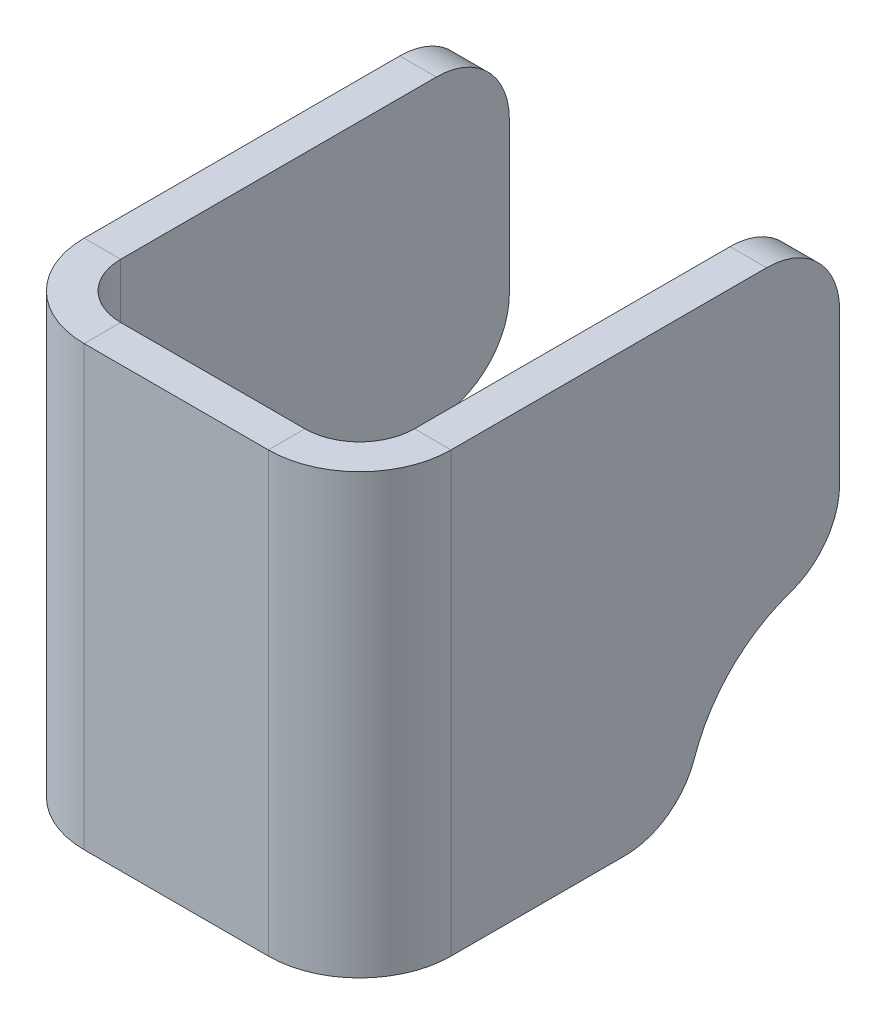
ISO-10303-21;
HEADER;
FILE_DESCRIPTION(('STEP AP214'),'2;1');
FILE_NAME('part.step','',(''),(''),'','','');
FILE_SCHEMA(('AUTOMOTIVE_DESIGN { 1 0 10303 214 1 1 1 1 }'));
ENDSEC;
DATA;
#1=APPLICATION_CONTEXT('core data for automotive mechanical design processes');
#2=APPLICATION_PROTOCOL_DEFINITION('international standard','automotive_design',2000,#1);
#3=PRODUCT_CONTEXT('',#1,'mechanical');
#4=PRODUCT('Part','Part','',(#3));
#5=PRODUCT_RELATED_PRODUCT_CATEGORY('part','',(#4));
#6=PRODUCT_DEFINITION_FORMATION('','',#4);
#7=PRODUCT_DEFINITION_CONTEXT('part definition',#1,'design');
#8=PRODUCT_DEFINITION('design','',#6,#7);
#9=PRODUCT_DEFINITION_SHAPE('','',#8);
#10=(LENGTH_UNIT() NAMED_UNIT(*) SI_UNIT(.MILLI.,.METRE.));
#11=(NAMED_UNIT(*) PLANE_ANGLE_UNIT() SI_UNIT($,.RADIAN.));
#12=(NAMED_UNIT(*) SI_UNIT($,.STERADIAN.) SOLID_ANGLE_UNIT());
#13=UNCERTAINTY_MEASURE_WITH_UNIT(LENGTH_MEASURE(1.E-05),#10,'distance_accuracy_value','');
#14=(GEOMETRIC_REPRESENTATION_CONTEXT(3) GLOBAL_UNCERTAINTY_ASSIGNED_CONTEXT((#13)) GLOBAL_UNIT_ASSIGNED_CONTEXT((#10,
#11,#12)) REPRESENTATION_CONTEXT('',''));
#15=CARTESIAN_POINT('',(0.,0.,0.));
#16=DIRECTION('',(0.,0.,1.));
#17=DIRECTION('',(1.,0.,0.));
#18=AXIS2_PLACEMENT_3D('',#15,#16,#17);
#19=CARTESIAN_POINT('',(32.3017633217904,0.,-79.8098725507499));
#20=DIRECTION('',(0.,1.,0.));
#21=DIRECTION('',(-1.,0.,0.));
#22=AXIS2_PLACEMENT_3D('',#19,#20,#21);
#23=PLANE('',#22);
#24=DIRECTION('',(0.,0.,1.));
#25=VECTOR('',#24,1.);
#26=CARTESIAN_POINT('',(29.1267633217904,0.,-79.8098725507499));
#27=LINE('',#26,#25);
#28=CARTESIAN_POINT('',(29.1267633217903,0.,-46.0375));
#29=VERTEX_POINT('',#28);
#30=CARTESIAN_POINT('',(29.1267633217903,0.,-61.1771935968261));
#31=VERTEX_POINT('',#30);
#32=EDGE_CURVE('E373',#29,#31,#27,.F.);
#33=ORIENTED_EDGE('',*,*,#32,.T.);
#34=DIRECTION('',(1.,0.,0.));
#35=VECTOR('',#34,1.);
#36=CARTESIAN_POINT('',(32.3017633217904,0.,-61.1771935968261));
#37=LINE('',#36,#35);
#38=CARTESIAN_POINT('',(32.3017633217903,0.,-61.1771935968261));
#39=VERTEX_POINT('',#38);
#40=EDGE_CURVE('E13',#31,#39,#37,.T.);
#41=ORIENTED_EDGE('',*,*,#40,.T.);
#42=DIRECTION('',(0.,0.,-1.));
#43=VECTOR('',#42,1.);
#44=CARTESIAN_POINT('',(32.3017633217901,0.,1.21599161523065E-13));
#45=LINE('',#44,#43);
#46=CARTESIAN_POINT('',(32.3017633217903,0.,-46.0375));
#47=VERTEX_POINT('',#46);
#48=EDGE_CURVE('E363',#47,#39,#45,.T.);
#49=ORIENTED_EDGE('',*,*,#48,.F.);
#50=DIRECTION('',(-1.,0.,0.));
#51=VECTOR('',#50,1.);
#52=CARTESIAN_POINT('',(29.1267633217903,0.,-46.0375));
#53=LINE('',#52,#51);
#54=EDGE_CURVE('E380',#29,#47,#53,.F.);
#55=ORIENTED_EDGE('',*,*,#54,.F.);
#56=EDGE_LOOP('',(#33,#41,#49,#55));
#57=FACE_BOUND('',#56,.T.);
#58=ADVANCED_FACE('F91',(#57),#23,.F.);
#59=CARTESIAN_POINT('',(32.3017633217904,38.1000000000016,-79.8098725507499));
#60=DIRECTION('',(0.,0.,1.));
#61=DIRECTION('',(1.,0.,0.));
#62=AXIS2_PLACEMENT_3D('',#59,#60,#61);
#63=PLANE('',#62);
#64=DIRECTION('',(0.,-1.,0.));
#65=VECTOR('',#64,1.);
#66=CARTESIAN_POINT('',(29.1267633217904,38.1000000000016,-79.8098725507499));
#67=LINE('',#66,#65);
#68=CARTESIAN_POINT('',(29.1267633217904,18.6326789539239,-79.8098725507499));
#69=VERTEX_POINT('',#68);
#70=CARTESIAN_POINT('',(29.1267633217904,31.7500000000016,-79.8098725507499));
#71=VERTEX_POINT('',#70);
#72=EDGE_CURVE('E369',#69,#71,#67,.F.);
#73=ORIENTED_EDGE('',*,*,#72,.T.);
#74=DIRECTION('',(-1.,0.,0.));
#75=VECTOR('',#74,1.);
#76=CARTESIAN_POINT('',(32.3017633217904,31.7500000000016,-79.8098725507499));
#77=LINE('',#76,#75);
#78=CARTESIAN_POINT('',(32.3017633217904,31.7500000000016,-79.8098725507499));
#79=VERTEX_POINT('',#78);
#80=EDGE_CURVE('E489',#71,#79,#77,.F.);
#81=ORIENTED_EDGE('',*,*,#80,.T.);
#82=DIRECTION('',(0.,1.,0.));
#83=VECTOR('',#82,1.);
#84=CARTESIAN_POINT('',(32.3017633217904,0.,-79.8098725507499));
#85=LINE('',#84,#83);
#86=CARTESIAN_POINT('',(32.3017633217904,18.6326789539239,-79.8098725507499));
#87=VERTEX_POINT('',#86);
#88=EDGE_CURVE('E359',#87,#79,#85,.T.);
#89=ORIENTED_EDGE('',*,*,#88,.F.);
#90=DIRECTION('',(1.,0.,0.));
#91=VECTOR('',#90,1.);
#92=CARTESIAN_POINT('',(29.1267633217904,18.6326789539239,-79.8098725507499));
#93=LINE('',#92,#91);
#94=EDGE_CURVE('E486',#87,#69,#93,.F.);
#95=ORIENTED_EDGE('',*,*,#94,.T.);
#96=EDGE_LOOP('',(#73,#81,#89,#95));
#97=FACE_BOUND('',#96,.T.);
#98=ADVANCED_FACE('F578',(#97),#63,.F.);
#99=CARTESIAN_POINT('',(0.42476332179028,0.,-41.275));
#100=DIRECTION('',(0.,1.,0.));
#101=DIRECTION('',(-1.,0.,0.));
#102=AXIS2_PLACEMENT_3D('',#99,#100,#101);
#103=PLANE('',#102);
#104=DIRECTION('',(0.,0.,1.));
#105=VECTOR('',#104,1.);
#106=CARTESIAN_POINT('',(0.424763321790424,0.,0.));
#107=LINE('',#106,#105);
#108=CARTESIAN_POINT('',(0.42476332179021,0.,-61.1771935968261));
#109=VERTEX_POINT('',#108);
#110=CARTESIAN_POINT('',(0.424763321790263,0.,-46.0375));
#111=VERTEX_POINT('',#110);
#112=EDGE_CURVE('E303',#109,#111,#107,.T.);
#113=ORIENTED_EDGE('',*,*,#112,.F.);
#114=DIRECTION('',(1.,0.,0.));
#115=VECTOR('',#114,1.);
#116=CARTESIAN_POINT('',(3.59976332179019,0.,-61.1771935968261));
#117=LINE('',#116,#115);
#118=CARTESIAN_POINT('',(3.59976332179021,0.,-61.1771935968261));
#119=VERTEX_POINT('',#118);
#120=EDGE_CURVE('E468',#109,#119,#117,.T.);
#121=ORIENTED_EDGE('',*,*,#120,.T.);
#122=DIRECTION('',(0.,0.,-1.));
#123=VECTOR('',#122,1.);
#124=CARTESIAN_POINT('',(3.59976332179028,0.,-41.275));
#125=LINE('',#124,#123);
#126=CARTESIAN_POINT('',(3.59976332179026,0.,-46.0375));
#127=VERTEX_POINT('',#126);
#128=EDGE_CURVE('E312',#119,#127,#125,.F.);
#129=ORIENTED_EDGE('',*,*,#128,.T.);
#130=DIRECTION('',(1.,0.,0.));
#131=VECTOR('',#130,1.);
#132=CARTESIAN_POINT('',(0.424763321790264,0.,-46.0375));
#133=LINE('',#132,#131);
#134=EDGE_CURVE('E329',#127,#111,#133,.F.);
#135=ORIENTED_EDGE('',*,*,#134,.T.);
#136=EDGE_LOOP('',(#113,#121,#129,#135));
#137=FACE_BOUND('',#136,.T.);
#138=ADVANCED_FACE('F547',(#137),#103,.F.);
#139=CARTESIAN_POINT('',(0.424763321790146,0.,-79.8098725507499));
#140=DIRECTION('',(0.,0.,1.));
#141=DIRECTION('',(1.,0.,0.));
#142=AXIS2_PLACEMENT_3D('',#139,#140,#141);
#143=PLANE('',#142);
#144=DIRECTION('',(0.,1.,0.));
#145=VECTOR('',#144,1.);
#146=CARTESIAN_POINT('',(3.59976332179015,0.,-79.8098725507499));
#147=LINE('',#146,#145);
#148=CARTESIAN_POINT('',(3.59976332179014,31.7500000000016,-79.8098725507499));
#149=VERTEX_POINT('',#148);
#150=CARTESIAN_POINT('',(3.59976332179014,18.6326789539239,-79.8098725507499));
#151=VERTEX_POINT('',#150);
#152=EDGE_CURVE('E319',#149,#151,#147,.F.);
#153=ORIENTED_EDGE('',*,*,#152,.T.);
#154=DIRECTION('',(1.,0.,0.));
#155=VECTOR('',#154,1.);
#156=CARTESIAN_POINT('',(0.424763321790122,18.6326789539239,-79.8098725507499));
#157=LINE('',#156,#155);
#158=CARTESIAN_POINT('',(0.424763321790143,18.6326789539239,-79.8098725507499));
#159=VERTEX_POINT('',#158);
#160=EDGE_CURVE('E456',#151,#159,#157,.F.);
#161=ORIENTED_EDGE('',*,*,#160,.T.);
#162=DIRECTION('',(0.,-1.,0.));
#163=VECTOR('',#162,1.);
#164=CARTESIAN_POINT('',(0.424763321790145,0.,-79.8098725507499));
#165=LINE('',#164,#163);
#166=CARTESIAN_POINT('',(0.424763321790141,31.7500000000016,-79.8098725507499));
#167=VERTEX_POINT('',#166);
#168=EDGE_CURVE('E311',#167,#159,#165,.T.);
#169=ORIENTED_EDGE('',*,*,#168,.F.);
#170=DIRECTION('',(1.,0.,0.));
#171=VECTOR('',#170,1.);
#172=CARTESIAN_POINT('',(0.424763321790142,31.7500000000016,-79.8098725507499));
#173=LINE('',#172,#171);
#174=EDGE_CURVE('E452',#167,#149,#173,.T.);
#175=ORIENTED_EDGE('',*,*,#174,.T.);
#176=EDGE_LOOP('',(#153,#161,#169,#175));
#177=FACE_BOUND('',#176,.T.);
#178=ADVANCED_FACE('F563',(#177),#143,.F.);
#179=CARTESIAN_POINT('',(0.,0.,-41.275));
#180=DIRECTION('',(0.,0.,1.));
#181=DIRECTION('',(1.,0.,0.));
#182=AXIS2_PLACEMENT_3D('',#179,#180,#181);
#183=PLANE('',#182);
#184=DIRECTION('',(0.,1.,0.));
#185=VECTOR('',#184,1.);
#186=CARTESIAN_POINT('',(8.36226332179026,38.1000000000016,-41.275));
#187=LINE('',#186,#185);
#188=CARTESIAN_POINT('',(8.36226332179026,38.1000000000016,-41.275));
#189=VERTEX_POINT('',#188);
#190=CARTESIAN_POINT('',(8.36226332179026,0.,-41.275));
#191=VERTEX_POINT('',#190);
#192=EDGE_CURVE('E343',#189,#191,#187,.F.);
#193=ORIENTED_EDGE('',*,*,#192,.F.);
#194=DIRECTION('',(-1.,0.,0.));
#195=VECTOR('',#194,1.);
#196=CARTESIAN_POINT('',(0.424763321790275,38.1000000000016,-41.275));
#197=LINE('',#196,#195);
#198=CARTESIAN_POINT('',(24.3642633217903,38.1000000000016,-41.275));
#199=VERTEX_POINT('',#198);
#200=EDGE_CURVE('E425',#199,#189,#197,.T.);
#201=ORIENTED_EDGE('',*,*,#200,.F.);
#202=DIRECTION('',(0.,-1.,0.));
#203=VECTOR('',#202,1.);
#204=CARTESIAN_POINT('',(24.3642633217903,0.,-41.275));
#205=LINE('',#204,#203);
#206=CARTESIAN_POINT('',(24.3642633217903,0.,-41.275));
#207=VERTEX_POINT('',#206);
#208=EDGE_CURVE('E407',#207,#199,#205,.F.);
#209=ORIENTED_EDGE('',*,*,#208,.F.);
#210=DIRECTION('',(1.,0.,0.));
#211=VECTOR('',#210,1.);
#212=CARTESIAN_POINT('',(0.42476332179028,0.,-41.275));
#213=LINE('',#212,#211);
#214=EDGE_CURVE('E421',#191,#207,#213,.T.);
#215=ORIENTED_EDGE('',*,*,#214,.F.);
#216=EDGE_LOOP('',(#193,#201,#209,#215));
#217=FACE_BOUND('',#216,.T.);
#218=ADVANCED_FACE('F606',(#217),#183,.F.);
#219=CARTESIAN_POINT('',(0.,0.,-38.1));
#220=DIRECTION('',(0.,0.,1.));
#221=DIRECTION('',(1.,0.,0.));
#222=AXIS2_PLACEMENT_3D('',#219,#220,#221);
#223=PLANE('',#222);
#224=DIRECTION('',(-1.,0.,0.));
#225=VECTOR('',#224,1.);
#226=CARTESIAN_POINT('',(0.424763321790275,38.1000000000016,-38.1));
#227=LINE('',#226,#225);
#228=CARTESIAN_POINT('',(24.3642633217903,38.1000000000016,-38.1));
#229=VERTEX_POINT('',#228);
#230=CARTESIAN_POINT('',(8.36226332179026,38.1000000000016,-38.1));
#231=VERTEX_POINT('',#230);
#232=EDGE_CURVE('E426',#229,#231,#227,.T.);
#233=ORIENTED_EDGE('',*,*,#232,.T.);
#234=DIRECTION('',(0.,1.,0.));
#235=VECTOR('',#234,1.);
#236=CARTESIAN_POINT('',(8.36226332179026,38.1000000000016,-38.1));
#237=LINE('',#236,#235);
#238=CARTESIAN_POINT('',(8.36226332179026,0.,-38.1));
#239=VERTEX_POINT('',#238);
#240=EDGE_CURVE('E277',#231,#239,#237,.F.);
#241=ORIENTED_EDGE('',*,*,#240,.T.);
#242=DIRECTION('',(1.,0.,0.));
#243=VECTOR('',#242,1.);
#244=CARTESIAN_POINT('',(0.42476332179028,0.,-38.1));
#245=LINE('',#244,#243);
#246=CARTESIAN_POINT('',(24.3642633217903,0.,-38.1));
#247=VERTEX_POINT('',#246);
#248=EDGE_CURVE('E417',#239,#247,#245,.T.);
#249=ORIENTED_EDGE('',*,*,#248,.T.);
#250=DIRECTION('',(0.,-1.,0.));
#251=VECTOR('',#250,1.);
#252=CARTESIAN_POINT('',(24.3642633217903,0.,-38.1));
#253=LINE('',#252,#251);
#254=EDGE_CURVE('E390',#247,#229,#253,.F.);
#255=ORIENTED_EDGE('',*,*,#254,.T.);
#256=EDGE_LOOP('',(#233,#241,#249,#255));
#257=FACE_BOUND('',#256,.T.);
#258=ADVANCED_FACE('F609',(#257),#223,.T.);
#259=CARTESIAN_POINT('',(0.424763321790275,38.1000000000016,-41.275));
#260=DIRECTION('',(0.,1.,0.));
#261=DIRECTION('',(0.,0.,1.));
#262=AXIS2_PLACEMENT_3D('',#259,#260,#261);
#263=PLANE('',#262);
#264=ORIENTED_EDGE('',*,*,#200,.T.);
#265=DIRECTION('',(0.,0.,1.));
#266=VECTOR('',#265,1.);
#267=CARTESIAN_POINT('',(8.36226332179026,38.1000000000016,-41.275));
#268=LINE('',#267,#266);
#269=EDGE_CURVE('E338',#189,#231,#268,.T.);
#270=ORIENTED_EDGE('',*,*,#269,.T.);
#271=ORIENTED_EDGE('',*,*,#232,.F.);
#272=DIRECTION('',(0.,0.,1.));
#273=VECTOR('',#272,1.);
#274=CARTESIAN_POINT('',(24.3642633217903,38.1000000000016,-41.275));
#275=LINE('',#274,#273);
#276=EDGE_CURVE('E413',#199,#229,#275,.T.);
#277=ORIENTED_EDGE('',*,*,#276,.F.);
#278=EDGE_LOOP('',(#264,#270,#271,#277));
#279=FACE_BOUND('',#278,.T.);
#280=ADVANCED_FACE('F613',(#279),#263,.T.);
#281=CARTESIAN_POINT('',(0.42476332179028,0.,-41.275));
#282=DIRECTION('',(0.,-1.,0.));
#283=DIRECTION('',(0.,0.,-1.));
#284=AXIS2_PLACEMENT_3D('',#281,#282,#283);
#285=PLANE('',#284);
#286=DIRECTION('',(0.,0.,1.));
#287=VECTOR('',#286,1.);
#288=CARTESIAN_POINT('',(8.36226332179026,0.,-41.275));
#289=LINE('',#288,#287);
#290=EDGE_CURVE('E348',#191,#239,#289,.T.);
#291=ORIENTED_EDGE('',*,*,#290,.F.);
#292=ORIENTED_EDGE('',*,*,#214,.T.);
#293=DIRECTION('',(0.,0.,1.));
#294=VECTOR('',#293,1.);
#295=CARTESIAN_POINT('',(24.3642633217903,0.,-41.275));
#296=LINE('',#295,#294);
#297=EDGE_CURVE('E399',#207,#247,#296,.T.);
#298=ORIENTED_EDGE('',*,*,#297,.T.);
#299=ORIENTED_EDGE('',*,*,#248,.F.);
#300=EDGE_LOOP('',(#291,#292,#298,#299));
#301=FACE_BOUND('',#300,.T.);
#302=ADVANCED_FACE('F601',(#301),#285,.T.);
#303=CARTESIAN_POINT('',(24.3642633217903,38.1000000000016,-46.0375));
#304=DIRECTION('',(0.,1.,0.));
#305=DIRECTION('',(0.,0.,1.));
#306=AXIS2_PLACEMENT_3D('',#303,#304,#305);
#307=PLANE('',#306);
#308=DIRECTION('',(-1.,0.,0.));
#309=VECTOR('',#308,1.);
#310=CARTESIAN_POINT('',(32.3017633217903,38.1000000000016,-46.0375));
#311=LINE('',#310,#309);
#312=CARTESIAN_POINT('',(29.1267633217903,38.1000000000016,-46.0375));
#313=VERTEX_POINT('',#312);
#314=CARTESIAN_POINT('',(32.3017633217903,38.1000000000016,-46.0375));
#315=VERTEX_POINT('',#314);
#316=EDGE_CURVE('E352',#313,#315,#311,.F.);
#317=ORIENTED_EDGE('',*,*,#316,.F.);
#318=CARTESIAN_POINT('',(24.3642633217903,38.1000000000016,-46.0375));
#319=DIRECTION('',(0.,-1.,0.));
#320=DIRECTION('',(0.,0.,-1.));
#321=AXIS2_PLACEMENT_3D('',#318,#319,#320);
#322=CIRCLE('',#321,4.7625);
#323=EDGE_CURVE('E403',#199,#313,#322,.F.);
#324=ORIENTED_EDGE('',*,*,#323,.F.);
#325=ORIENTED_EDGE('',*,*,#276,.T.);
#326=CARTESIAN_POINT('',(24.3642633217903,38.1000000000016,-46.0375));
#327=DIRECTION('',(0.,-1.,0.));
#328=DIRECTION('',(0.,0.,-1.));
#329=AXIS2_PLACEMENT_3D('',#326,#327,#328);
#330=CIRCLE('',#329,7.9375);
#331=EDGE_CURVE('E394',#229,#315,#330,.F.);
#332=ORIENTED_EDGE('',*,*,#331,.T.);
#333=EDGE_LOOP('',(#317,#324,#325,#332));
#334=FACE_BOUND('',#333,.T.);
#335=ADVANCED_FACE('F598',(#334),#307,.T.);
#336=CARTESIAN_POINT('',(24.3642633217903,0.,-46.0375));
#337=DIRECTION('',(0.,1.,0.));
#338=DIRECTION('',(0.,0.,1.));
#339=AXIS2_PLACEMENT_3D('',#336,#337,#338);
#340=PLANE('',#339);
#341=CARTESIAN_POINT('',(24.3642633217903,0.,-46.0375));
#342=DIRECTION('',(0.,-1.,0.));
#343=DIRECTION('',(0.,0.,-1.));
#344=AXIS2_PLACEMENT_3D('',#341,#342,#343);
#345=CIRCLE('',#344,4.7625);
#346=EDGE_CURVE('E358',#29,#207,#345,.T.);
#347=ORIENTED_EDGE('',*,*,#346,.F.);
#348=ORIENTED_EDGE('',*,*,#54,.T.);
#349=CARTESIAN_POINT('',(24.3642633217903,0.,-46.0375));
#350=DIRECTION('',(0.,-1.,0.));
#351=DIRECTION('',(0.,0.,-1.));
#352=AXIS2_PLACEMENT_3D('',#349,#350,#351);
#353=CIRCLE('',#352,7.9375);
#354=EDGE_CURVE('E395',#47,#247,#353,.T.);
#355=ORIENTED_EDGE('',*,*,#354,.T.);
#356=ORIENTED_EDGE('',*,*,#297,.F.);
#357=EDGE_LOOP('',(#347,#348,#355,#356));
#358=FACE_BOUND('',#357,.T.);
#359=ADVANCED_FACE('F592',(#358),#340,.F.);
#360=CARTESIAN_POINT('',(24.3642633217903,0.,-46.0375));
#361=DIRECTION('',(0.,-1.,0.));
#362=DIRECTION('',(1.,0.,0.));
#363=AXIS2_PLACEMENT_3D('',#360,#361,#362);
#364=CYLINDRICAL_SURFACE('',#363,7.9375);
#365=ORIENTED_EDGE('',*,*,#254,.F.);
#366=ORIENTED_EDGE('',*,*,#354,.F.);
#367=DIRECTION('',(0.,-1.,0.));
#368=VECTOR('',#367,1.);
#369=CARTESIAN_POINT('',(32.3017633217903,38.1000000000016,-46.0375));
#370=LINE('',#369,#368);
#371=EDGE_CURVE('E376',#47,#315,#370,.F.);
#372=ORIENTED_EDGE('',*,*,#371,.T.);
#373=ORIENTED_EDGE('',*,*,#331,.F.);
#374=EDGE_LOOP('',(#365,#366,#372,#373));
#375=FACE_BOUND('',#374,.T.);
#376=ADVANCED_FACE('F588',(#375),#364,.T.);
#377=CARTESIAN_POINT('',(24.3642633217903,0.,-46.0375));
#378=DIRECTION('',(0.,-1.,0.));
#379=DIRECTION('',(1.,0.,0.));
#380=AXIS2_PLACEMENT_3D('',#377,#378,#379);
#381=CYLINDRICAL_SURFACE('',#380,4.7625);
#382=ORIENTED_EDGE('',*,*,#208,.T.);
#383=ORIENTED_EDGE('',*,*,#323,.T.);
#384=DIRECTION('',(0.,-1.,0.));
#385=VECTOR('',#384,1.);
#386=CARTESIAN_POINT('',(29.1267633217903,38.1000000000016,-46.0375));
#387=LINE('',#386,#385);
#388=EDGE_CURVE('E384',#313,#29,#387,.T.);
#389=ORIENTED_EDGE('',*,*,#388,.T.);
#390=ORIENTED_EDGE('',*,*,#346,.T.);
#391=EDGE_LOOP('',(#382,#383,#389,#390));
#392=FACE_BOUND('',#391,.T.);
#393=ADVANCED_FACE('F591',(#392),#381,.F.);
#394=CARTESIAN_POINT('',(32.3017633217903,38.1000000000016,-41.275));
#395=DIRECTION('',(0.,-1.,0.));
#396=DIRECTION('',(1.,0.,0.));
#397=AXIS2_PLACEMENT_3D('',#394,#395,#396);
#398=PLANE('',#397);
#399=DIRECTION('',(0.,0.,1.));
#400=VECTOR('',#399,1.);
#401=CARTESIAN_POINT('',(32.3017633217901,38.1000000000016,1.21599161523065E-13));
#402=LINE('',#401,#400);
#403=CARTESIAN_POINT('',(32.3017633217904,38.1000000000016,-73.4598725507499));
#404=VERTEX_POINT('',#403);
#405=EDGE_CURVE('E355',#404,#315,#402,.T.);
#406=ORIENTED_EDGE('',*,*,#405,.F.);
#407=DIRECTION('',(-1.,0.,0.));
#408=VECTOR('',#407,1.);
#409=CARTESIAN_POINT('',(32.3017633217904,38.1000000000016,-73.4598725507499));
#410=LINE('',#409,#408);
#411=CARTESIAN_POINT('',(29.1267633217904,38.1000000000016,-73.4598725507499));
#412=VERTEX_POINT('',#411);
#413=EDGE_CURVE('E473',#404,#412,#410,.T.);
#414=ORIENTED_EDGE('',*,*,#413,.T.);
#415=DIRECTION('',(0.,0.,-1.));
#416=VECTOR('',#415,1.);
#417=CARTESIAN_POINT('',(29.1267633217903,38.1000000000016,-41.275));
#418=LINE('',#417,#416);
#419=EDGE_CURVE('E366',#412,#313,#418,.F.);
#420=ORIENTED_EDGE('',*,*,#419,.T.);
#421=ORIENTED_EDGE('',*,*,#316,.T.);
#422=EDGE_LOOP('',(#406,#414,#420,#421));
#423=FACE_BOUND('',#422,.T.);
#424=ADVANCED_FACE('F596',(#423),#398,.F.);
#425=CARTESIAN_POINT('',(32.3017633217901,0.,1.21599161523065E-13));
#426=DIRECTION('',(-1.,0.,0.));
#427=DIRECTION('',(0.,0.,1.));
#428=AXIS2_PLACEMENT_3D('',#425,#426,#427);
#429=PLANE('',#428);
#430=ORIENTED_EDGE('',*,*,#88,.T.);
#431=CARTESIAN_POINT('',(32.3017633217904,31.7500000000016,-73.4598725507499));
#432=DIRECTION('',(-1.,0.,0.));
#433=DIRECTION('',(0.,0.,1.));
#434=AXIS2_PLACEMENT_3D('',#431,#432,#433);
#435=CIRCLE('',#434,6.35);
#436=EDGE_CURVE('E497',#79,#404,#435,.F.);
#437=ORIENTED_EDGE('',*,*,#436,.T.);
#438=ORIENTED_EDGE('',*,*,#405,.T.);
#439=ORIENTED_EDGE('',*,*,#371,.F.);
#440=ORIENTED_EDGE('',*,*,#48,.T.);
#441=CARTESIAN_POINT('',(32.3017633217903,6.35,-61.1771935968261));
#442=DIRECTION('',(-1.,0.,0.));
#443=DIRECTION('',(0.,0.,1.));
#444=AXIS2_PLACEMENT_3D('',#441,#442,#443);
#445=CIRCLE('',#444,6.35);
#446=CARTESIAN_POINT('',(32.3017633217904,4.3016129032258,-67.1877351948661));
#447=VERTEX_POINT('',#446);
#448=EDGE_CURVE('E117',#39,#447,#445,.F.);
#449=ORIENTED_EDGE('',*,*,#448,.T.);
#450=CARTESIAN_POINT('',(32.3017633217904,0.,-79.80987255075));
#451=DIRECTION('',(1.,0.,0.));
#452=DIRECTION('',(0.,0.,-1.));
#453=AXIS2_PLACEMENT_3D('',#450,#451,#452);
#454=CIRCLE('',#453,13.335);
#455=CARTESIAN_POINT('',(32.3017633217904,12.622137355884,-75.5082596475242));
#456=VERTEX_POINT('',#455);
#457=EDGE_CURVE('E512',#456,#447,#454,.T.);
#458=ORIENTED_EDGE('',*,*,#457,.F.);
#459=CARTESIAN_POINT('',(32.3017633217904,18.6326789539239,-73.45987255075));
#460=DIRECTION('',(-1.,0.,0.));
#461=DIRECTION('',(0.,0.,1.));
#462=AXIS2_PLACEMENT_3D('',#459,#460,#461);
#463=CIRCLE('',#462,6.35);
#464=EDGE_CURVE('E492',#456,#87,#463,.F.);
#465=ORIENTED_EDGE('',*,*,#464,.T.);
#466=EDGE_LOOP('',(#430,#437,#438,#439,#440,#449,#458,#465));
#467=FACE_BOUND('',#466,.T.);
#468=ADVANCED_FACE('F633',(#467),#429,.F.);
#469=CARTESIAN_POINT('',(29.1267633217901,0.,1.10513708272238E-13));
#470=DIRECTION('',(-1.,0.,0.));
#471=DIRECTION('',(0.,0.,1.));
#472=AXIS2_PLACEMENT_3D('',#469,#470,#471);
#473=PLANE('',#472);
#474=ORIENTED_EDGE('',*,*,#419,.F.);
#475=CARTESIAN_POINT('',(29.1267633217904,31.7500000000016,-73.4598725507499));
#476=DIRECTION('',(-1.,0.,0.));
#477=DIRECTION('',(0.,0.,1.));
#478=AXIS2_PLACEMENT_3D('',#475,#476,#477);
#479=CIRCLE('',#478,6.35);
#480=EDGE_CURVE('E483',#412,#71,#479,.T.);
#481=ORIENTED_EDGE('',*,*,#480,.T.);
#482=ORIENTED_EDGE('',*,*,#72,.F.);
#483=CARTESIAN_POINT('',(29.1267633217904,18.6326789539239,-73.45987255075));
#484=DIRECTION('',(-1.,0.,0.));
#485=DIRECTION('',(0.,0.,1.));
#486=AXIS2_PLACEMENT_3D('',#483,#484,#485);
#487=CIRCLE('',#486,6.35);
#488=CARTESIAN_POINT('',(29.1267633217904,12.622137355884,-75.5082596475242));
#489=VERTEX_POINT('',#488);
#490=EDGE_CURVE('E477',#69,#489,#487,.T.);
#491=ORIENTED_EDGE('',*,*,#490,.T.);
#492=CARTESIAN_POINT('',(29.1267633217904,0.,-79.80987255075));
#493=DIRECTION('',(-1.,0.,0.));
#494=DIRECTION('',(0.,0.,1.));
#495=AXIS2_PLACEMENT_3D('',#492,#493,#494);
#496=CIRCLE('',#495,13.335);
#497=CARTESIAN_POINT('',(29.1267633217904,4.3016129032258,-67.1877351948661));
#498=VERTEX_POINT('',#497);
#499=EDGE_CURVE('E333',#489,#498,#496,.F.);
#500=ORIENTED_EDGE('',*,*,#499,.T.);
#501=CARTESIAN_POINT('',(29.1267633217903,6.35,-61.1771935968261));
#502=DIRECTION('',(-1.,0.,0.));
#503=DIRECTION('',(0.,0.,1.));
#504=AXIS2_PLACEMENT_3D('',#501,#502,#503);
#505=CIRCLE('',#504,6.35);
#506=EDGE_CURVE('E480',#498,#31,#505,.T.);
#507=ORIENTED_EDGE('',*,*,#506,.T.);
#508=ORIENTED_EDGE('',*,*,#32,.F.);
#509=ORIENTED_EDGE('',*,*,#388,.F.);
#510=EDGE_LOOP('',(#474,#481,#482,#491,#500,#507,#508,#509));
#511=FACE_BOUND('',#510,.T.);
#512=ADVANCED_FACE('F516',(#511),#473,.T.);
#513=CARTESIAN_POINT('',(8.36226332179026,0.,-46.0375));
#514=DIRECTION('',(0.,-1.,0.));
#515=DIRECTION('',(0.,0.,-1.));
#516=AXIS2_PLACEMENT_3D('',#513,#514,#515);
#517=PLANE('',#516);
#518=ORIENTED_EDGE('',*,*,#134,.F.);
#519=CARTESIAN_POINT('',(8.36226332179026,0.,-46.0375));
#520=DIRECTION('',(0.,1.,0.));
#521=DIRECTION('',(0.,0.,1.));
#522=AXIS2_PLACEMENT_3D('',#519,#520,#521);
#523=CIRCLE('',#522,4.7625);
#524=EDGE_CURVE('E281',#191,#127,#523,.F.);
#525=ORIENTED_EDGE('',*,*,#524,.F.);
#526=ORIENTED_EDGE('',*,*,#290,.T.);
#527=CARTESIAN_POINT('',(8.36226332179026,0.,-46.0375));
#528=DIRECTION('',(0.,1.,0.));
#529=DIRECTION('',(0.,0.,1.));
#530=AXIS2_PLACEMENT_3D('',#527,#528,#529);
#531=CIRCLE('',#530,7.9375);
#532=EDGE_CURVE('E336',#239,#111,#531,.F.);
#533=ORIENTED_EDGE('',*,*,#532,.T.);
#534=EDGE_LOOP('',(#518,#525,#526,#533));
#535=FACE_BOUND('',#534,.T.);
#536=ADVANCED_FACE('F551',(#535),#517,.T.);
#537=CARTESIAN_POINT('',(8.36226332179026,38.1000000000016,-46.0375));
#538=DIRECTION('',(0.,-1.,0.));
#539=DIRECTION('',(0.,0.,-1.));
#540=AXIS2_PLACEMENT_3D('',#537,#538,#539);
#541=PLANE('',#540);
#542=CARTESIAN_POINT('',(8.36226332179026,38.1000000000016,-46.0375));
#543=DIRECTION('',(0.,1.,0.));
#544=DIRECTION('',(0.,0.,1.));
#545=AXIS2_PLACEMENT_3D('',#542,#543,#544);
#546=CIRCLE('',#545,4.7625);
#547=CARTESIAN_POINT('',(3.59976332179026,38.1000000000016,-46.0375));
#548=VERTEX_POINT('',#547);
#549=EDGE_CURVE('E288',#548,#189,#546,.T.);
#550=ORIENTED_EDGE('',*,*,#549,.F.);
#551=DIRECTION('',(1.,0.,0.));
#552=VECTOR('',#551,1.);
#553=CARTESIAN_POINT('',(3.59976332179025,38.1000000000016,-46.0375));
#554=LINE('',#553,#552);
#555=CARTESIAN_POINT('',(0.424763321790258,38.1000000000016,-46.0375));
#556=VERTEX_POINT('',#555);
#557=EDGE_CURVE('E285',#548,#556,#554,.F.);
#558=ORIENTED_EDGE('',*,*,#557,.T.);
#559=CARTESIAN_POINT('',(8.36226332179026,38.1000000000016,-46.0375));
#560=DIRECTION('',(0.,1.,0.));
#561=DIRECTION('',(0.,0.,1.));
#562=AXIS2_PLACEMENT_3D('',#559,#560,#561);
#563=CIRCLE('',#562,7.9375);
#564=EDGE_CURVE('E270',#556,#231,#563,.T.);
#565=ORIENTED_EDGE('',*,*,#564,.T.);
#566=ORIENTED_EDGE('',*,*,#269,.F.);
#567=EDGE_LOOP('',(#550,#558,#565,#566));
#568=FACE_BOUND('',#567,.T.);
#569=ADVANCED_FACE('F286',(#568),#541,.F.);
#570=CARTESIAN_POINT('',(8.36226332179026,38.1000000000016,-46.0375));
#571=DIRECTION('',(0.,1.,0.));
#572=DIRECTION('',(-1.,0.,0.));
#573=AXIS2_PLACEMENT_3D('',#570,#571,#572);
#574=CYLINDRICAL_SURFACE('',#573,7.9375);
#575=ORIENTED_EDGE('',*,*,#240,.F.);
#576=ORIENTED_EDGE('',*,*,#564,.F.);
#577=DIRECTION('',(0.,1.,0.));
#578=VECTOR('',#577,1.);
#579=CARTESIAN_POINT('',(0.424763321790263,0.,-46.0375));
#580=LINE('',#579,#578);
#581=EDGE_CURVE('E274',#556,#111,#580,.F.);
#582=ORIENTED_EDGE('',*,*,#581,.T.);
#583=ORIENTED_EDGE('',*,*,#532,.F.);
#584=EDGE_LOOP('',(#575,#576,#582,#583));
#585=FACE_BOUND('',#584,.T.);
#586=ADVANCED_FACE('F272',(#585),#574,.T.);
#587=CARTESIAN_POINT('',(8.36226332179026,38.1000000000016,-46.0375));
#588=DIRECTION('',(0.,1.,0.));
#589=DIRECTION('',(-1.,0.,0.));
#590=AXIS2_PLACEMENT_3D('',#587,#588,#589);
#591=CYLINDRICAL_SURFACE('',#590,4.7625);
#592=ORIENTED_EDGE('',*,*,#192,.T.);
#593=ORIENTED_EDGE('',*,*,#524,.T.);
#594=DIRECTION('',(0.,1.,0.));
#595=VECTOR('',#594,1.);
#596=CARTESIAN_POINT('',(3.59976332179026,0.,-46.0375));
#597=LINE('',#596,#595);
#598=EDGE_CURVE('E294',#127,#548,#597,.T.);
#599=ORIENTED_EDGE('',*,*,#598,.T.);
#600=ORIENTED_EDGE('',*,*,#549,.T.);
#601=EDGE_LOOP('',(#592,#593,#599,#600));
#602=FACE_BOUND('',#601,.T.);
#603=ADVANCED_FACE('F555',(#602),#591,.F.);
#604=CARTESIAN_POINT('',(0.424763321790141,38.1000000000016,-79.8098725507499));
#605=DIRECTION('',(0.,-1.,0.));
#606=DIRECTION('',(1.,0.,0.));
#607=AXIS2_PLACEMENT_3D('',#604,#605,#606);
#608=PLANE('',#607);
#609=DIRECTION('',(0.,0.,1.));
#610=VECTOR('',#609,1.);
#611=CARTESIAN_POINT('',(3.59976332179014,38.1000000000016,-79.8098725507499));
#612=LINE('',#611,#610);
#613=CARTESIAN_POINT('',(3.59976332179016,38.1000000000016,-73.4598725507499));
#614=VERTEX_POINT('',#613);
#615=EDGE_CURVE('E305',#548,#614,#612,.F.);
#616=ORIENTED_EDGE('',*,*,#615,.T.);
#617=DIRECTION('',(1.,0.,0.));
#618=VECTOR('',#617,1.);
#619=CARTESIAN_POINT('',(0.424763321790163,38.1000000000016,-73.4598725507499));
#620=LINE('',#619,#618);
#621=CARTESIAN_POINT('',(0.424763321790163,38.1000000000016,-73.4598725507499));
#622=VERTEX_POINT('',#621);
#623=EDGE_CURVE('E309',#614,#622,#620,.F.);
#624=ORIENTED_EDGE('',*,*,#623,.T.);
#625=DIRECTION('',(0.,0.,-1.));
#626=VECTOR('',#625,1.);
#627=CARTESIAN_POINT('',(0.424763321790419,38.1000000000016,0.));
#628=LINE('',#627,#626);
#629=EDGE_CURVE('E300',#556,#622,#628,.T.);
#630=ORIENTED_EDGE('',*,*,#629,.F.);
#631=ORIENTED_EDGE('',*,*,#557,.F.);
#632=EDGE_LOOP('',(#616,#624,#630,#631));
#633=FACE_BOUND('',#632,.T.);
#634=ADVANCED_FACE('F307',(#633),#608,.F.);
#635=CARTESIAN_POINT('',(0.424763321790424,0.,0.));
#636=DIRECTION('',(1.,0.,0.));
#637=DIRECTION('',(0.,0.,-1.));
#638=AXIS2_PLACEMENT_3D('',#635,#636,#637);
#639=PLANE('',#638);
#640=ORIENTED_EDGE('',*,*,#168,.T.);
#641=CARTESIAN_POINT('',(0.424763321790165,18.6326789539239,-73.4598725507499));
#642=DIRECTION('',(1.,0.,0.));
#643=DIRECTION('',(0.,0.,-1.));
#644=AXIS2_PLACEMENT_3D('',#641,#642,#643);
#645=CIRCLE('',#644,6.35);
#646=CARTESIAN_POINT('',(0.424763321790159,12.6221373558839,-75.5082596475241));
#647=VERTEX_POINT('',#646);
#648=EDGE_CURVE('E465',#159,#647,#645,.F.);
#649=ORIENTED_EDGE('',*,*,#648,.T.);
#650=CARTESIAN_POINT('',(0.424763321790145,0.,-79.80987255075));
#651=DIRECTION('',(1.,0.,0.));
#652=DIRECTION('',(0.,0.,-1.));
#653=AXIS2_PLACEMENT_3D('',#650,#651,#652);
#654=CIRCLE('',#653,13.335);
#655=CARTESIAN_POINT('',(0.424763321790189,4.30161290322581,-67.1877351948661));
#656=VERTEX_POINT('',#655);
#657=EDGE_CURVE('E521',#656,#647,#654,.F.);
#658=ORIENTED_EDGE('',*,*,#657,.F.);
#659=CARTESIAN_POINT('',(0.42476332179021,6.35,-61.1771935968261));
#660=DIRECTION('',(1.,0.,0.));
#661=DIRECTION('',(0.,0.,-1.));
#662=AXIS2_PLACEMENT_3D('',#659,#660,#661);
#663=CIRCLE('',#662,6.35);
#664=EDGE_CURVE('E462',#656,#109,#663,.F.);
#665=ORIENTED_EDGE('',*,*,#664,.T.);
#666=ORIENTED_EDGE('',*,*,#112,.T.);
#667=ORIENTED_EDGE('',*,*,#581,.F.);
#668=ORIENTED_EDGE('',*,*,#629,.T.);
#669=CARTESIAN_POINT('',(0.424763321790164,31.7500000000016,-73.4598725507499));
#670=DIRECTION('',(1.,0.,0.));
#671=DIRECTION('',(0.,0.,-1.));
#672=AXIS2_PLACEMENT_3D('',#669,#670,#671);
#673=CIRCLE('',#672,6.35);
#674=EDGE_CURVE('E459',#622,#167,#673,.F.);
#675=ORIENTED_EDGE('',*,*,#674,.T.);
#676=EDGE_LOOP('',(#640,#649,#658,#665,#666,#667,#668,#675));
#677=FACE_BOUND('',#676,.T.);
#678=ADVANCED_FACE('F299',(#677),#639,.F.);
#679=CARTESIAN_POINT('',(3.59976332179042,0.,0.));
#680=DIRECTION('',(1.,0.,0.));
#681=DIRECTION('',(0.,0.,-1.));
#682=AXIS2_PLACEMENT_3D('',#679,#680,#681);
#683=PLANE('',#682);
#684=CARTESIAN_POINT('',(3.59976332179015,0.,-79.80987255075));
#685=DIRECTION('',(1.,0.,0.));
#686=DIRECTION('',(0.,0.,-1.));
#687=AXIS2_PLACEMENT_3D('',#684,#685,#686);
#688=CIRCLE('',#687,13.335);
#689=CARTESIAN_POINT('',(3.59976332179019,4.30161290322581,-67.1877351948661));
#690=VERTEX_POINT('',#689);
#691=CARTESIAN_POINT('',(3.59976332179016,12.6221373558839,-75.5082596475241));
#692=VERTEX_POINT('',#691);
#693=EDGE_CURVE('E525',#690,#692,#688,.F.);
#694=ORIENTED_EDGE('',*,*,#693,.T.);
#695=CARTESIAN_POINT('',(3.59976332179017,18.6326789539239,-73.4598725507499));
#696=DIRECTION('',(1.,0.,0.));
#697=DIRECTION('',(0.,0.,-1.));
#698=AXIS2_PLACEMENT_3D('',#695,#696,#697);
#699=CIRCLE('',#698,6.35);
#700=EDGE_CURVE('E449',#692,#151,#699,.T.);
#701=ORIENTED_EDGE('',*,*,#700,.T.);
#702=ORIENTED_EDGE('',*,*,#152,.F.);
#703=CARTESIAN_POINT('',(3.59976332179016,31.7500000000016,-73.4598725507499));
#704=DIRECTION('',(1.,0.,0.));
#705=DIRECTION('',(0.,0.,-1.));
#706=AXIS2_PLACEMENT_3D('',#703,#704,#705);
#707=CIRCLE('',#706,6.35);
#708=EDGE_CURVE('E443',#149,#614,#707,.T.);
#709=ORIENTED_EDGE('',*,*,#708,.T.);
#710=ORIENTED_EDGE('',*,*,#615,.F.);
#711=ORIENTED_EDGE('',*,*,#598,.F.);
#712=ORIENTED_EDGE('',*,*,#128,.F.);
#713=CARTESIAN_POINT('',(3.59976332179021,6.35,-61.1771935968261));
#714=DIRECTION('',(1.,0.,0.));
#715=DIRECTION('',(0.,0.,-1.));
#716=AXIS2_PLACEMENT_3D('',#713,#714,#715);
#717=CIRCLE('',#716,6.35);
#718=EDGE_CURVE('E446',#119,#690,#717,.T.);
#719=ORIENTED_EDGE('',*,*,#718,.T.);
#720=EDGE_LOOP('',(#694,#701,#702,#709,#710,#711,#712,#719));
#721=FACE_BOUND('',#720,.T.);
#722=ADVANCED_FACE('F534',(#721),#683,.T.);
#723=CARTESIAN_POINT('',(0.424763321790141,0.,-79.80987255075));
#724=DIRECTION('',(-1.,0.,0.));
#725=DIRECTION('',(0.,0.,1.));
#726=AXIS2_PLACEMENT_3D('',#723,#724,#725);
#727=CYLINDRICAL_SURFACE('',#726,13.335);
#728=ORIENTED_EDGE('',*,*,#657,.T.);
#729=DIRECTION('',(-1.,0.,0.));
#730=VECTOR('',#729,1.);
#731=CARTESIAN_POINT('',(0.424763321790141,12.6221373558839,-75.5082596475241));
#732=LINE('',#731,#730);
#733=EDGE_CURVE('E439',#647,#692,#732,.F.);
#734=ORIENTED_EDGE('',*,*,#733,.T.);
#735=ORIENTED_EDGE('',*,*,#693,.F.);
#736=DIRECTION('',(-1.,0.,0.));
#737=VECTOR('',#736,1.);
#738=CARTESIAN_POINT('',(0.424763321790141,4.30161290322581,-67.1877351948661));
#739=LINE('',#738,#737);
#740=EDGE_CURVE('E430',#690,#656,#739,.T.);
#741=ORIENTED_EDGE('',*,*,#740,.T.);
#742=EDGE_LOOP('',(#728,#734,#735,#741));
#743=FACE_BOUND('',#742,.T.);
#744=ADVANCED_FACE('F540',(#743),#727,.F.);
#745=ORIENTED_EDGE('',*,*,#457,.T.);
#746=DIRECTION('',(-1.,0.,0.));
#747=VECTOR('',#746,1.);
#748=CARTESIAN_POINT('',(0.424763321790141,4.30161290322581,-67.1877351948661));
#749=LINE('',#748,#747);
#750=EDGE_CURVE('E100',#447,#498,#749,.T.);
#751=ORIENTED_EDGE('',*,*,#750,.T.);
#752=ORIENTED_EDGE('',*,*,#499,.F.);
#753=DIRECTION('',(-1.,0.,0.));
#754=VECTOR('',#753,1.);
#755=CARTESIAN_POINT('',(0.424763321790141,12.622137355884,-75.5082596475242));
#756=LINE('',#755,#754);
#757=EDGE_CURVE('E500',#489,#456,#756,.F.);
#758=ORIENTED_EDGE('',*,*,#757,.T.);
#759=EDGE_LOOP('',(#745,#751,#752,#758));
#760=FACE_BOUND('',#759,.T.);
#761=ADVANCED_FACE('F510',(#760),#727,.F.);
#762=CARTESIAN_POINT('',(0.424763321790163,18.6326789539239,-73.4598725507499));
#763=DIRECTION('',(-1.,0.,0.));
#764=DIRECTION('',(0.,0.,1.));
#765=AXIS2_PLACEMENT_3D('',#762,#763,#764);
#766=CYLINDRICAL_SURFACE('',#765,6.35);
#767=ORIENTED_EDGE('',*,*,#648,.F.);
#768=ORIENTED_EDGE('',*,*,#160,.F.);
#769=ORIENTED_EDGE('',*,*,#700,.F.);
#770=ORIENTED_EDGE('',*,*,#733,.F.);
#771=EDGE_LOOP('',(#767,#768,#769,#770));
#772=FACE_BOUND('',#771,.T.);
#773=ADVANCED_FACE('F566',(#772),#766,.T.);
#774=CARTESIAN_POINT('',(0.42476332179014,6.35,-61.1771935968261));
#775=DIRECTION('',(-1.,0.,0.));
#776=DIRECTION('',(0.,0.,1.));
#777=AXIS2_PLACEMENT_3D('',#774,#775,#776);
#778=CYLINDRICAL_SURFACE('',#777,6.35);
#779=ORIENTED_EDGE('',*,*,#718,.F.);
#780=ORIENTED_EDGE('',*,*,#120,.F.);
#781=ORIENTED_EDGE('',*,*,#664,.F.);
#782=ORIENTED_EDGE('',*,*,#740,.F.);
#783=EDGE_LOOP('',(#779,#780,#781,#782));
#784=FACE_BOUND('',#783,.T.);
#785=ADVANCED_FACE('F544',(#784),#778,.T.);
#786=CARTESIAN_POINT('',(0.424763321790164,31.7500000000016,-73.4598725507499));
#787=DIRECTION('',(1.,0.,0.));
#788=DIRECTION('',(0.,0.,-1.));
#789=AXIS2_PLACEMENT_3D('',#786,#787,#788);
#790=CYLINDRICAL_SURFACE('',#789,6.35);
#791=ORIENTED_EDGE('',*,*,#674,.F.);
#792=ORIENTED_EDGE('',*,*,#623,.F.);
#793=ORIENTED_EDGE('',*,*,#708,.F.);
#794=ORIENTED_EDGE('',*,*,#174,.F.);
#795=EDGE_LOOP('',(#791,#792,#793,#794));
#796=FACE_BOUND('',#795,.T.);
#797=ADVANCED_FACE('F558',(#796),#790,.T.);
#798=CARTESIAN_POINT('',(32.3017633217904,31.7500000000016,-73.4598725507499));
#799=DIRECTION('',(-1.,0.,0.));
#800=DIRECTION('',(0.,0.,1.));
#801=AXIS2_PLACEMENT_3D('',#798,#799,#800);
#802=CYLINDRICAL_SURFACE('',#801,6.35);
#803=ORIENTED_EDGE('',*,*,#436,.F.);
#804=ORIENTED_EDGE('',*,*,#80,.F.);
#805=ORIENTED_EDGE('',*,*,#480,.F.);
#806=ORIENTED_EDGE('',*,*,#413,.F.);
#807=EDGE_LOOP('',(#803,#804,#805,#806));
#808=FACE_BOUND('',#807,.T.);
#809=ADVANCED_FACE('F639',(#808),#802,.T.);
#810=CARTESIAN_POINT('',(0.424763321790142,6.35,-61.1771935968261));
#811=DIRECTION('',(-1.,0.,0.));
#812=DIRECTION('',(0.,0.,1.));
#813=AXIS2_PLACEMENT_3D('',#810,#811,#812);
#814=CYLINDRICAL_SURFACE('',#813,6.35);
#815=ORIENTED_EDGE('',*,*,#448,.F.);
#816=ORIENTED_EDGE('',*,*,#40,.F.);
#817=ORIENTED_EDGE('',*,*,#506,.F.);
#818=ORIENTED_EDGE('',*,*,#750,.F.);
#819=EDGE_LOOP('',(#815,#816,#817,#818));
#820=FACE_BOUND('',#819,.T.);
#821=ADVANCED_FACE('F637',(#820),#814,.T.);
#822=CARTESIAN_POINT('',(0.424763321790119,18.6326789539239,-73.45987255075));
#823=DIRECTION('',(-1.,0.,0.));
#824=DIRECTION('',(0.,0.,1.));
#825=AXIS2_PLACEMENT_3D('',#822,#823,#824);
#826=CYLINDRICAL_SURFACE('',#825,6.35);
#827=ORIENTED_EDGE('',*,*,#490,.F.);
#828=ORIENTED_EDGE('',*,*,#94,.F.);
#829=ORIENTED_EDGE('',*,*,#464,.F.);
#830=ORIENTED_EDGE('',*,*,#757,.F.);
#831=EDGE_LOOP('',(#827,#828,#829,#830));
#832=FACE_BOUND('',#831,.T.);
#833=ADVANCED_FACE('F93',(#832),#826,.T.);
#834=CLOSED_SHELL('',(#58,#98,#138,#178,#218,#258,#280,#302,#335,#359,#376,#393,#424,#468,#512,
#536,#569,#586,#603,#634,#678,#722,#744,#761,#773,#785,#797,#809,#821,#833));
#835=MANIFOLD_SOLID_BREP('B2',#834);
#836=ADVANCED_BREP_SHAPE_REPRESENTATION('',(#18,#835),#14);
#837=SHAPE_DEFINITION_REPRESENTATION(#9,#836);
ENDSEC;
END-ISO-10303-21;
